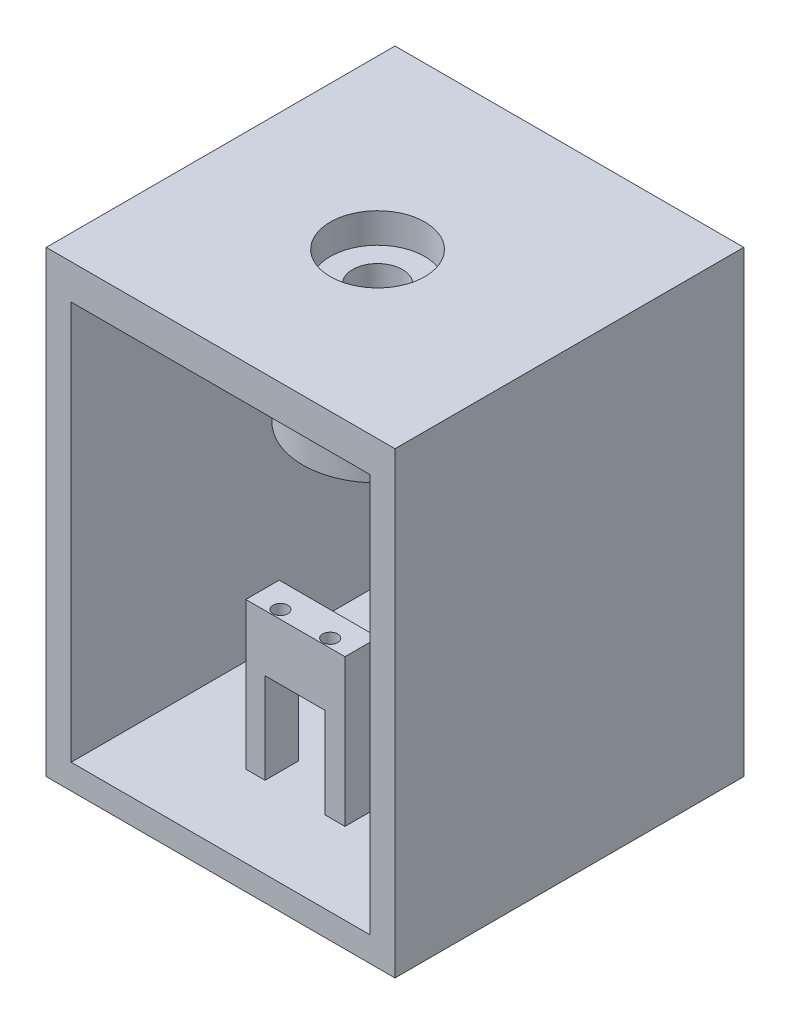
ISO-10303-21;
HEADER;
FILE_DESCRIPTION(('STEP AP214'),'2;1');
FILE_NAME('part.step','',(''),(''),'','','');
FILE_SCHEMA(('AUTOMOTIVE_DESIGN { 1 0 10303 214 1 1 1 1 }'));
ENDSEC;
DATA;
#1=APPLICATION_CONTEXT('core data for automotive mechanical design processes');
#2=APPLICATION_PROTOCOL_DEFINITION('international standard','automotive_design',2000,#1);
#3=PRODUCT_CONTEXT('',#1,'mechanical');
#4=PRODUCT('Part','Part','',(#3));
#5=PRODUCT_RELATED_PRODUCT_CATEGORY('part','',(#4));
#6=PRODUCT_DEFINITION_FORMATION('','',#4);
#7=PRODUCT_DEFINITION_CONTEXT('part definition',#1,'design');
#8=PRODUCT_DEFINITION('design','',#6,#7);
#9=PRODUCT_DEFINITION_SHAPE('','',#8);
#10=(LENGTH_UNIT() NAMED_UNIT(*) SI_UNIT(.MILLI.,.METRE.));
#11=(NAMED_UNIT(*) PLANE_ANGLE_UNIT() SI_UNIT($,.RADIAN.));
#12=(NAMED_UNIT(*) SI_UNIT($,.STERADIAN.) SOLID_ANGLE_UNIT());
#13=UNCERTAINTY_MEASURE_WITH_UNIT(LENGTH_MEASURE(1.E-05),#10,'distance_accuracy_value','');
#14=(GEOMETRIC_REPRESENTATION_CONTEXT(3) GLOBAL_UNCERTAINTY_ASSIGNED_CONTEXT((#13)) GLOBAL_UNIT_ASSIGNED_CONTEXT((#10,
#11,#12)) REPRESENTATION_CONTEXT('',''));
#15=CARTESIAN_POINT('',(0.,0.,0.));
#16=DIRECTION('',(0.,0.,1.));
#17=DIRECTION('',(1.,0.,0.));
#18=AXIS2_PLACEMENT_3D('',#15,#16,#17);
#19=CARTESIAN_POINT('',(-4.64981001313193,-50.5,14.8500000000001));
#20=DIRECTION('',(0.,1.,0.));
#21=DIRECTION('',(0.,0.,1.));
#22=AXIS2_PLACEMENT_3D('',#19,#20,#21);
#23=PLANE('',#22);
#24=CARTESIAN_POINT('',(-4.64981001313193,-50.5,14.8500000000001));
#25=DIRECTION('',(0.,1.,0.));
#26=DIRECTION('',(0.,0.,1.));
#27=AXIS2_PLACEMENT_3D('',#24,#25,#26);
#28=CIRCLE('',#27,1.5);
#29=CARTESIAN_POINT('',(-4.64981001313193,-50.5,16.3500000000001));
#30=VERTEX_POINT('',#29);
#31=EDGE_CURVE('E271',#30,#30,#28,.T.);
#32=ORIENTED_EDGE('',*,*,#31,.T.);
#33=EDGE_LOOP('',(#32));
#34=FACE_BOUND('',#33,.T.);
#35=ADVANCED_FACE('F34',(#34),#23,.T.);
#36=CARTESIAN_POINT('',(5.35018998686807,-50.5,14.8500000000001));
#37=DIRECTION('',(0.,1.,0.));
#38=DIRECTION('',(0.,0.,1.));
#39=AXIS2_PLACEMENT_3D('',#36,#37,#38);
#40=PLANE('',#39);
#41=CARTESIAN_POINT('',(5.35018998686807,-50.5,14.8500000000001));
#42=DIRECTION('',(0.,1.,0.));
#43=DIRECTION('',(0.,0.,1.));
#44=AXIS2_PLACEMENT_3D('',#41,#42,#43);
#45=CIRCLE('',#44,1.5);
#46=CARTESIAN_POINT('',(5.35018998686807,-50.5,16.3500000000001));
#47=VERTEX_POINT('',#46);
#48=EDGE_CURVE('E269',#47,#47,#45,.T.);
#49=ORIENTED_EDGE('',*,*,#48,.T.);
#50=EDGE_LOOP('',(#49));
#51=FACE_BOUND('',#50,.T.);
#52=ADVANCED_FACE('F616',(#51),#40,.T.);
#53=CARTESIAN_POINT('',(0.,-7.,0.));
#54=DIRECTION('',(0.,-1.,0.));
#55=DIRECTION('',(0.,0.,-1.));
#56=AXIS2_PLACEMENT_3D('',#53,#54,#55);
#57=PLANE('',#56);
#58=CARTESIAN_POINT('',(0.,-7.,0.));
#59=DIRECTION('',(0.,-1.,0.));
#60=DIRECTION('',(0.,0.,-1.));
#61=AXIS2_PLACEMENT_3D('',#58,#59,#60);
#62=CIRCLE('',#61,5.);
#63=CARTESIAN_POINT('',(0.,-7.,-5.));
#64=VERTEX_POINT('',#63);
#65=EDGE_CURVE('E276',#64,#64,#62,.T.);
#66=ORIENTED_EDGE('',*,*,#65,.F.);
#67=EDGE_LOOP('',(#66));
#68=FACE_BOUND('',#67,.T.);
#69=CARTESIAN_POINT('',(0.,-7.,0.));
#70=DIRECTION('',(0.,-1.,0.));
#71=DIRECTION('',(0.,0.,-1.));
#72=AXIS2_PLACEMENT_3D('',#69,#70,#71);
#73=CIRCLE('',#72,9.5);
#74=CARTESIAN_POINT('',(0.,-7.,-9.5));
#75=VERTEX_POINT('',#74);
#76=EDGE_CURVE('E37',#75,#75,#73,.T.);
#77=ORIENTED_EDGE('',*,*,#76,.T.);
#78=EDGE_LOOP('',(#77));
#79=FACE_BOUND('',#78,.T.);
#80=ADVANCED_FACE('F613',(#68,#79),#57,.T.);
#81=CARTESIAN_POINT('',(0.,-7.,0.));
#82=DIRECTION('',(0.,-1.,0.));
#83=DIRECTION('',(0.,0.,-1.));
#84=AXIS2_PLACEMENT_3D('',#81,#82,#83);
#85=CYLINDRICAL_SURFACE('',#84,9.5);
#86=ORIENTED_EDGE('',*,*,#76,.F.);
#87=EDGE_LOOP('',(#86));
#88=FACE_BOUND('',#87,.T.);
#89=CARTESIAN_POINT('',(0.,-13.,0.));
#90=DIRECTION('',(0.,-1.,0.));
#91=DIRECTION('',(0.,0.,-1.));
#92=AXIS2_PLACEMENT_3D('',#89,#90,#91);
#93=CIRCLE('',#92,9.5);
#94=CARTESIAN_POINT('',(0.,-13.,-9.5));
#95=VERTEX_POINT('',#94);
#96=EDGE_CURVE('E266',#95,#95,#93,.T.);
#97=ORIENTED_EDGE('',*,*,#96,.T.);
#98=EDGE_LOOP('',(#97));
#99=FACE_BOUND('',#98,.T.);
#100=ADVANCED_FACE('F609',(#88,#99),#85,.F.);
#101=CARTESIAN_POINT('',(-4.64981001313193,-50.5,14.8500000000001));
#102=DIRECTION('',(0.,1.,0.));
#103=DIRECTION('',(0.,0.,1.));
#104=AXIS2_PLACEMENT_3D('',#101,#102,#103);
#105=CYLINDRICAL_SURFACE('',#104,1.5);
#106=CARTESIAN_POINT('',(-4.64981001313193,-40.5,14.8500000000001));
#107=DIRECTION('',(0.,1.,0.));
#108=DIRECTION('',(0.,0.,1.));
#109=AXIS2_PLACEMENT_3D('',#106,#107,#108);
#110=CIRCLE('',#109,1.5);
#111=CARTESIAN_POINT('',(-4.64981001313193,-40.5,16.3500000000001));
#112=VERTEX_POINT('',#111);
#113=EDGE_CURVE('E263',#112,#112,#110,.F.);
#114=ORIENTED_EDGE('',*,*,#113,.F.);
#115=EDGE_LOOP('',(#114));
#116=FACE_BOUND('',#115,.T.);
#117=ORIENTED_EDGE('',*,*,#31,.F.);
#118=EDGE_LOOP('',(#117));
#119=FACE_BOUND('',#118,.T.);
#120=ADVANCED_FACE('F602',(#116,#119),#105,.F.);
#121=CARTESIAN_POINT('',(5.35018998686807,-50.5,14.8500000000001));
#122=DIRECTION('',(0.,1.,0.));
#123=DIRECTION('',(0.,0.,1.));
#124=AXIS2_PLACEMENT_3D('',#121,#122,#123);
#125=CYLINDRICAL_SURFACE('',#124,1.5);
#126=CARTESIAN_POINT('',(5.35018998686807,-40.5,14.8500000000001));
#127=DIRECTION('',(0.,1.,0.));
#128=DIRECTION('',(0.,0.,1.));
#129=AXIS2_PLACEMENT_3D('',#126,#127,#128);
#130=CIRCLE('',#129,1.5);
#131=CARTESIAN_POINT('',(5.35018998686807,-40.5,16.3500000000001));
#132=VERTEX_POINT('',#131);
#133=EDGE_CURVE('E260',#132,#132,#130,.F.);
#134=ORIENTED_EDGE('',*,*,#133,.F.);
#135=EDGE_LOOP('',(#134));
#136=FACE_BOUND('',#135,.T.);
#137=ORIENTED_EDGE('',*,*,#48,.F.);
#138=EDGE_LOOP('',(#137));
#139=FACE_BOUND('',#138,.T.);
#140=ADVANCED_FACE('F594',(#136,#139),#125,.F.);
#141=CARTESIAN_POINT('',(5.35018998686808,-50.5,-35.6499999999999));
#142=DIRECTION('',(0.,1.,0.));
#143=DIRECTION('',(0.,0.,1.));
#144=AXIS2_PLACEMENT_3D('',#141,#142,#143);
#145=PLANE('',#144);
#146=CARTESIAN_POINT('',(5.35018998686808,-50.5,-35.6499999999999));
#147=DIRECTION('',(0.,1.,0.));
#148=DIRECTION('',(0.,0.,1.));
#149=AXIS2_PLACEMENT_3D('',#146,#147,#148);
#150=CIRCLE('',#149,1.425);
#151=CARTESIAN_POINT('',(5.35018998686808,-50.5,-34.2249999999999));
#152=VERTEX_POINT('',#151);
#153=EDGE_CURVE('E257',#152,#152,#150,.T.);
#154=ORIENTED_EDGE('',*,*,#153,.T.);
#155=EDGE_LOOP('',(#154));
#156=FACE_BOUND('',#155,.T.);
#157=ADVANCED_FACE('F591',(#156),#145,.T.);
#158=CARTESIAN_POINT('',(-4.64981001313192,-50.5,-35.6499999999999));
#159=DIRECTION('',(0.,1.,0.));
#160=DIRECTION('',(0.,0.,1.));
#161=AXIS2_PLACEMENT_3D('',#158,#159,#160);
#162=PLANE('',#161);
#163=CARTESIAN_POINT('',(-4.64981001313192,-50.5,-35.6499999999999));
#164=DIRECTION('',(0.,1.,0.));
#165=DIRECTION('',(0.,0.,1.));
#166=AXIS2_PLACEMENT_3D('',#163,#164,#165);
#167=CIRCLE('',#166,1.425);
#168=CARTESIAN_POINT('',(-4.64981001313192,-50.5,-34.2249999999999));
#169=VERTEX_POINT('',#168);
#170=EDGE_CURVE('E254',#169,#169,#167,.T.);
#171=ORIENTED_EDGE('',*,*,#170,.T.);
#172=EDGE_LOOP('',(#171));
#173=FACE_BOUND('',#172,.T.);
#174=ADVANCED_FACE('F593',(#173),#162,.T.);
#175=CARTESIAN_POINT('',(0.,-13.,0.));
#176=DIRECTION('',(0.,1.,0.));
#177=DIRECTION('',(0.,0.,1.));
#178=AXIS2_PLACEMENT_3D('',#175,#176,#177);
#179=PLANE('',#178);
#180=CARTESIAN_POINT('',(0.,-13.,0.));
#181=DIRECTION('',(0.,1.,0.));
#182=DIRECTION('',(0.,0.,1.));
#183=AXIS2_PLACEMENT_3D('',#180,#181,#182);
#184=CIRCLE('',#183,15.);
#185=CARTESIAN_POINT('',(0.,-13.,15.));
#186=VERTEX_POINT('',#185);
#187=EDGE_CURVE('E228',#186,#186,#184,.T.);
#188=ORIENTED_EDGE('',*,*,#187,.F.);
#189=EDGE_LOOP('',(#188));
#190=FACE_BOUND('',#189,.T.);
#191=ORIENTED_EDGE('',*,*,#96,.F.);
#192=EDGE_LOOP('',(#191));
#193=FACE_BOUND('',#192,.T.);
#194=ADVANCED_FACE('F480',(#190,#193),#179,.F.);
#195=CARTESIAN_POINT('',(0.,-40.5,0.));
#196=DIRECTION('',(0.,1.,0.));
#197=DIRECTION('',(0.,0.,1.));
#198=AXIS2_PLACEMENT_3D('',#195,#196,#197);
#199=PLANE('',#198);
#200=DIRECTION('',(0.,0.,1.));
#201=VECTOR('',#200,1.);
#202=CARTESIAN_POINT('',(10.037036461965,-40.5,9.87558863527532));
#203=LINE('',#202,#201);
#204=CARTESIAN_POINT('',(10.037036461965,-40.5,16.5755886352753));
#205=VERTEX_POINT('',#204);
#206=CARTESIAN_POINT('',(10.037036461965,-40.5,9.87558863527532));
#207=VERTEX_POINT('',#206);
#208=EDGE_CURVE('E222',#205,#207,#203,.F.);
#209=ORIENTED_EDGE('',*,*,#208,.T.);
#210=DIRECTION('',(1.,0.,0.));
#211=VECTOR('',#210,1.);
#212=CARTESIAN_POINT('',(-9.86296353803503,-40.5,9.87558863527533));
#213=LINE('',#212,#211);
#214=CARTESIAN_POINT('',(-9.86296353803503,-40.5,9.87558863527533));
#215=VERTEX_POINT('',#214);
#216=EDGE_CURVE('E213',#207,#215,#213,.F.);
#217=ORIENTED_EDGE('',*,*,#216,.T.);
#218=DIRECTION('',(0.,0.,-1.));
#219=VECTOR('',#218,1.);
#220=CARTESIAN_POINT('',(-9.86296353803503,-40.5,9.87558863527533));
#221=LINE('',#220,#219);
#222=CARTESIAN_POINT('',(-9.86296353803503,-40.5,16.5755886352753));
#223=VERTEX_POINT('',#222);
#224=EDGE_CURVE('E196',#215,#223,#221,.F.);
#225=ORIENTED_EDGE('',*,*,#224,.T.);
#226=DIRECTION('',(-1.,0.,0.));
#227=VECTOR('',#226,1.);
#228=CARTESIAN_POINT('',(-9.86296353803503,-40.5,16.5755886352753));
#229=LINE('',#228,#227);
#230=EDGE_CURVE('E434',#223,#205,#229,.F.);
#231=ORIENTED_EDGE('',*,*,#230,.T.);
#232=EDGE_LOOP('',(#209,#217,#225,#231));
#233=FACE_BOUND('',#232,.T.);
#234=ORIENTED_EDGE('',*,*,#133,.T.);
#235=EDGE_LOOP('',(#234));
#236=FACE_BOUND('',#235,.T.);
#237=ORIENTED_EDGE('',*,*,#113,.T.);
#238=EDGE_LOOP('',(#237));
#239=FACE_BOUND('',#238,.T.);
#240=ADVANCED_FACE('F220',(#233,#236,#239),#199,.T.);
#241=CARTESIAN_POINT('',(-6.,-51.82567157,32.9055886352753));
#242=DIRECTION('',(0.,1.,0.));
#243=DIRECTION('',(0.,0.,1.));
#244=AXIS2_PLACEMENT_3D('',#241,#242,#243);
#245=PLANE('',#244);
#246=DIRECTION('',(1.,0.,0.));
#247=VECTOR('',#246,1.);
#248=CARTESIAN_POINT('',(-9.86296353803503,-51.82567157,9.87558863527533));
#249=LINE('',#248,#247);
#250=CARTESIAN_POINT('',(-6.,-51.82567157,9.87558863527533));
#251=VERTEX_POINT('',#250);
#252=CARTESIAN_POINT('',(6.,-51.82567157,9.87558863527533));
#253=VERTEX_POINT('',#252);
#254=EDGE_CURVE('E446',#251,#253,#249,.T.);
#255=ORIENTED_EDGE('',*,*,#254,.T.);
#256=DIRECTION('',(0.,0.,1.));
#257=VECTOR('',#256,1.);
#258=CARTESIAN_POINT('',(6.,-51.82567157,-37.0944113647247));
#259=LINE('',#258,#257);
#260=CARTESIAN_POINT('',(6.,-51.82567157,16.5755886352753));
#261=VERTEX_POINT('',#260);
#262=EDGE_CURVE('E207',#253,#261,#259,.T.);
#263=ORIENTED_EDGE('',*,*,#262,.T.);
#264=DIRECTION('',(-1.,0.,0.));
#265=VECTOR('',#264,1.);
#266=CARTESIAN_POINT('',(-9.86296353803503,-51.82567157,16.5755886352753));
#267=LINE('',#266,#265);
#268=CARTESIAN_POINT('',(-6.,-51.82567157,16.5755886352753));
#269=VERTEX_POINT('',#268);
#270=EDGE_CURVE('E251',#261,#269,#267,.T.);
#271=ORIENTED_EDGE('',*,*,#270,.T.);
#272=DIRECTION('',(0.,0.,1.));
#273=VECTOR('',#272,1.);
#274=CARTESIAN_POINT('',(-6.,-51.82567157,-37.0944113647247));
#275=LINE('',#274,#273);
#276=EDGE_CURVE('E191',#269,#251,#275,.F.);
#277=ORIENTED_EDGE('',*,*,#276,.T.);
#278=EDGE_LOOP('',(#255,#263,#271,#277));
#279=FACE_BOUND('',#278,.T.);
#280=ADVANCED_FACE('F469',(#279),#245,.F.);
#281=CARTESIAN_POINT('',(0.,11.,0.));
#282=DIRECTION('',(0.,1.,0.));
#283=DIRECTION('',(0.,0.,1.));
#284=AXIS2_PLACEMENT_3D('',#281,#282,#283);
#285=PLANE('',#284);
#286=CARTESIAN_POINT('',(0.,11.,0.));
#287=DIRECTION('',(0.,1.,0.));
#288=DIRECTION('',(0.,0.,1.));
#289=AXIS2_PLACEMENT_3D('',#286,#287,#288);
#290=CIRCLE('',#289,5.);
#291=CARTESIAN_POINT('',(0.,11.,5.));
#292=VERTEX_POINT('',#291);
#293=EDGE_CURVE('E280',#292,#292,#290,.T.);
#294=ORIENTED_EDGE('',*,*,#293,.F.);
#295=EDGE_LOOP('',(#294));
#296=FACE_BOUND('',#295,.T.);
#297=CARTESIAN_POINT('',(0.,11.,0.));
#298=DIRECTION('',(0.,1.,0.));
#299=DIRECTION('',(0.,0.,1.));
#300=AXIS2_PLACEMENT_3D('',#297,#298,#299);
#301=CIRCLE('',#300,9.5);
#302=CARTESIAN_POINT('',(0.,11.,9.5));
#303=VERTEX_POINT('',#302);
#304=EDGE_CURVE('E247',#303,#303,#301,.T.);
#305=ORIENTED_EDGE('',*,*,#304,.T.);
#306=EDGE_LOOP('',(#305));
#307=FACE_BOUND('',#306,.T.);
#308=ADVANCED_FACE('F471',(#296,#307),#285,.T.);
#309=CARTESIAN_POINT('',(5.35018998686808,-50.5,-35.6499999999999));
#310=DIRECTION('',(0.,1.,0.));
#311=DIRECTION('',(0.,0.,1.));
#312=AXIS2_PLACEMENT_3D('',#309,#310,#311);
#313=CYLINDRICAL_SURFACE('',#312,1.425);
#314=CARTESIAN_POINT('',(5.35018998686808,-40.5,-35.6499999999999));
#315=DIRECTION('',(0.,1.,0.));
#316=DIRECTION('',(0.,0.,1.));
#317=AXIS2_PLACEMENT_3D('',#314,#315,#316);
#318=CIRCLE('',#317,1.425);
#319=CARTESIAN_POINT('',(5.35018998686808,-40.5,-34.2249999999999));
#320=VERTEX_POINT('',#319);
#321=EDGE_CURVE('E243',#320,#320,#318,.F.);
#322=ORIENTED_EDGE('',*,*,#321,.F.);
#323=EDGE_LOOP('',(#322));
#324=FACE_BOUND('',#323,.T.);
#325=ORIENTED_EDGE('',*,*,#153,.F.);
#326=EDGE_LOOP('',(#325));
#327=FACE_BOUND('',#326,.T.);
#328=ADVANCED_FACE('F477',(#324,#327),#313,.F.);
#329=CARTESIAN_POINT('',(-4.64981001313192,-50.5,-35.6499999999999));
#330=DIRECTION('',(0.,1.,0.));
#331=DIRECTION('',(0.,0.,1.));
#332=AXIS2_PLACEMENT_3D('',#329,#330,#331);
#333=CYLINDRICAL_SURFACE('',#332,1.425);
#334=CARTESIAN_POINT('',(-4.64981001313192,-40.5,-35.6499999999999));
#335=DIRECTION('',(0.,1.,0.));
#336=DIRECTION('',(0.,0.,1.));
#337=AXIS2_PLACEMENT_3D('',#334,#335,#336);
#338=CIRCLE('',#337,1.425);
#339=CARTESIAN_POINT('',(-4.64981001313192,-40.5,-34.2249999999999));
#340=VERTEX_POINT('',#339);
#341=EDGE_CURVE('E239',#340,#340,#338,.F.);
#342=ORIENTED_EDGE('',*,*,#341,.F.);
#343=EDGE_LOOP('',(#342));
#344=FACE_BOUND('',#343,.T.);
#345=ORIENTED_EDGE('',*,*,#170,.F.);
#346=EDGE_LOOP('',(#345));
#347=FACE_BOUND('',#346,.T.);
#348=ADVANCED_FACE('F578',(#344,#347),#333,.F.);
#349=CARTESIAN_POINT('',(0.,-13.,0.));
#350=DIRECTION('',(0.,1.,0.));
#351=DIRECTION('',(0.,0.,1.));
#352=AXIS2_PLACEMENT_3D('',#349,#350,#351);
#353=CYLINDRICAL_SURFACE('',#352,15.);
#354=ORIENTED_EDGE('',*,*,#187,.T.);
#355=EDGE_LOOP('',(#354));
#356=FACE_BOUND('',#355,.T.);
#357=CARTESIAN_POINT('',(0.,10.,0.));
#358=DIRECTION('',(0.,1.,0.));
#359=DIRECTION('',(0.,0.,1.));
#360=AXIS2_PLACEMENT_3D('',#357,#358,#359);
#361=CIRCLE('',#360,15.);
#362=CARTESIAN_POINT('',(0.,10.,15.));
#363=VERTEX_POINT('',#362);
#364=EDGE_CURVE('E234',#363,#363,#361,.F.);
#365=ORIENTED_EDGE('',*,*,#364,.T.);
#366=EDGE_LOOP('',(#365));
#367=FACE_BOUND('',#366,.T.);
#368=ADVANCED_FACE('F575',(#356,#367),#353,.T.);
#369=CARTESIAN_POINT('',(-6.,-54.,-37.0944113647247));
#370=DIRECTION('',(-1.,0.,0.));
#371=DIRECTION('',(0.,-1.,0.));
#372=AXIS2_PLACEMENT_3D('',#369,#370,#371);
#373=PLANE('',#372);
#374=DIRECTION('',(0.,1.,0.));
#375=VECTOR('',#374,1.);
#376=CARTESIAN_POINT('',(-6.,-40.5,9.87558863527533));
#377=LINE('',#376,#375);
#378=CARTESIAN_POINT('',(-6.,-70.,9.87558863527533));
#379=VERTEX_POINT('',#378);
#380=EDGE_CURVE('E217',#379,#251,#377,.T.);
#381=ORIENTED_EDGE('',*,*,#380,.T.);
#382=ORIENTED_EDGE('',*,*,#276,.F.);
#383=DIRECTION('',(0.,1.,0.));
#384=VECTOR('',#383,1.);
#385=CARTESIAN_POINT('',(-6.,-40.5,16.5755886352753));
#386=LINE('',#385,#384);
#387=CARTESIAN_POINT('',(-6.,-70.,16.5755886352753));
#388=VERTEX_POINT('',#387);
#389=EDGE_CURVE('E437',#269,#388,#386,.F.);
#390=ORIENTED_EDGE('',*,*,#389,.T.);
#391=DIRECTION('',(0.,0.,1.));
#392=VECTOR('',#391,1.);
#393=CARTESIAN_POINT('',(-6.,-70.,0.));
#394=LINE('',#393,#392);
#395=EDGE_CURVE('E390',#379,#388,#394,.T.);
#396=ORIENTED_EDGE('',*,*,#395,.F.);
#397=EDGE_LOOP('',(#381,#382,#390,#396));
#398=FACE_BOUND('',#397,.T.);
#399=ADVANCED_FACE('F450',(#398),#373,.F.);
#400=CARTESIAN_POINT('',(-9.86296353803503,-40.5,9.87558863527533));
#401=DIRECTION('',(1.,0.,0.));
#402=DIRECTION('',(0.,0.,-1.));
#403=AXIS2_PLACEMENT_3D('',#400,#401,#402);
#404=PLANE('',#403);
#405=DIRECTION('',(0.,1.,0.));
#406=VECTOR('',#405,1.);
#407=CARTESIAN_POINT('',(-9.86296353803503,-40.5,16.5755886352753));
#408=LINE('',#407,#406);
#409=CARTESIAN_POINT('',(-9.86296353803503,-70.,16.5755886352753));
#410=VERTEX_POINT('',#409);
#411=EDGE_CURVE('E202',#410,#223,#408,.T.);
#412=ORIENTED_EDGE('',*,*,#411,.T.);
#413=ORIENTED_EDGE('',*,*,#224,.F.);
#414=DIRECTION('',(0.,1.,0.));
#415=VECTOR('',#414,1.);
#416=CARTESIAN_POINT('',(-9.86296353803503,-40.5,9.87558863527533));
#417=LINE('',#416,#415);
#418=CARTESIAN_POINT('',(-9.86296353803503,-70.,9.87558863527533));
#419=VERTEX_POINT('',#418);
#420=EDGE_CURVE('E200',#215,#419,#417,.F.);
#421=ORIENTED_EDGE('',*,*,#420,.T.);
#422=DIRECTION('',(0.,0.,1.));
#423=VECTOR('',#422,1.);
#424=CARTESIAN_POINT('',(-9.86296353803503,-70.,0.));
#425=LINE('',#424,#423);
#426=EDGE_CURVE('E385',#410,#419,#425,.F.);
#427=ORIENTED_EDGE('',*,*,#426,.F.);
#428=EDGE_LOOP('',(#412,#413,#421,#427));
#429=FACE_BOUND('',#428,.T.);
#430=ADVANCED_FACE('F198',(#429),#404,.F.);
#431=CARTESIAN_POINT('',(6.,-54.,-37.0944113647247));
#432=DIRECTION('',(1.,0.,0.));
#433=DIRECTION('',(0.,1.,0.));
#434=AXIS2_PLACEMENT_3D('',#431,#432,#433);
#435=PLANE('',#434);
#436=ORIENTED_EDGE('',*,*,#262,.F.);
#437=DIRECTION('',(0.,1.,0.));
#438=VECTOR('',#437,1.);
#439=CARTESIAN_POINT('',(6.,-40.5,9.87558863527532));
#440=LINE('',#439,#438);
#441=CARTESIAN_POINT('',(6.,-70.,9.87558863527533));
#442=VERTEX_POINT('',#441);
#443=EDGE_CURVE('E443',#253,#442,#440,.F.);
#444=ORIENTED_EDGE('',*,*,#443,.T.);
#445=DIRECTION('',(0.,0.,1.));
#446=VECTOR('',#445,1.);
#447=CARTESIAN_POINT('',(6.,-70.,0.));
#448=LINE('',#447,#446);
#449=CARTESIAN_POINT('',(6.,-70.,16.5755886352753));
#450=VERTEX_POINT('',#449);
#451=EDGE_CURVE('E383',#450,#442,#448,.F.);
#452=ORIENTED_EDGE('',*,*,#451,.F.);
#453=DIRECTION('',(0.,1.,0.));
#454=VECTOR('',#453,1.);
#455=CARTESIAN_POINT('',(6.,-40.5,16.5755886352753));
#456=LINE('',#455,#454);
#457=EDGE_CURVE('E428',#450,#261,#456,.T.);
#458=ORIENTED_EDGE('',*,*,#457,.T.);
#459=EDGE_LOOP('',(#436,#444,#452,#458));
#460=FACE_BOUND('',#459,.T.);
#461=ADVANCED_FACE('F468',(#460),#435,.F.);
#462=CARTESIAN_POINT('',(-9.86296353803503,-40.5,9.87558863527533));
#463=DIRECTION('',(0.,0.,1.));
#464=DIRECTION('',(1.,0.,0.));
#465=AXIS2_PLACEMENT_3D('',#462,#463,#464);
#466=PLANE('',#465);
#467=ORIENTED_EDGE('',*,*,#254,.F.);
#468=ORIENTED_EDGE('',*,*,#380,.F.);
#469=DIRECTION('',(1.,0.,0.));
#470=VECTOR('',#469,1.);
#471=CARTESIAN_POINT('',(0.,-70.,9.87558863527533));
#472=LINE('',#471,#470);
#473=EDGE_CURVE('E216',#419,#379,#472,.T.);
#474=ORIENTED_EDGE('',*,*,#473,.F.);
#475=ORIENTED_EDGE('',*,*,#420,.F.);
#476=ORIENTED_EDGE('',*,*,#216,.F.);
#477=DIRECTION('',(0.,1.,0.));
#478=VECTOR('',#477,1.);
#479=CARTESIAN_POINT('',(10.037036461965,-40.5,9.87558863527532));
#480=LINE('',#479,#478);
#481=CARTESIAN_POINT('',(10.037036461965,-70.,9.87558863527532));
#482=VERTEX_POINT('',#481);
#483=EDGE_CURVE('E440',#207,#482,#480,.F.);
#484=ORIENTED_EDGE('',*,*,#483,.T.);
#485=DIRECTION('',(1.,0.,0.));
#486=VECTOR('',#485,1.);
#487=CARTESIAN_POINT('',(0.,-70.,9.87558863527533));
#488=LINE('',#487,#486);
#489=EDGE_CURVE('E381',#442,#482,#488,.T.);
#490=ORIENTED_EDGE('',*,*,#489,.F.);
#491=ORIENTED_EDGE('',*,*,#443,.F.);
#492=EDGE_LOOP('',(#467,#468,#474,#475,#476,#484,#490,#491));
#493=FACE_BOUND('',#492,.T.);
#494=ADVANCED_FACE('F211',(#493),#466,.F.);
#495=CARTESIAN_POINT('',(10.037036461965,-40.5,9.87558863527532));
#496=DIRECTION('',(-1.,0.,0.));
#497=DIRECTION('',(0.,0.,1.));
#498=AXIS2_PLACEMENT_3D('',#495,#496,#497);
#499=PLANE('',#498);
#500=ORIENTED_EDGE('',*,*,#483,.F.);
#501=ORIENTED_EDGE('',*,*,#208,.F.);
#502=DIRECTION('',(0.,1.,0.));
#503=VECTOR('',#502,1.);
#504=CARTESIAN_POINT('',(10.037036461965,-40.5,16.5755886352753));
#505=LINE('',#504,#503);
#506=CARTESIAN_POINT('',(10.037036461965,-70.,16.5755886352753));
#507=VERTEX_POINT('',#506);
#508=EDGE_CURVE('E431',#205,#507,#505,.F.);
#509=ORIENTED_EDGE('',*,*,#508,.T.);
#510=DIRECTION('',(0.,0.,1.));
#511=VECTOR('',#510,1.);
#512=CARTESIAN_POINT('',(10.037036461965,-70.,0.));
#513=LINE('',#512,#511);
#514=EDGE_CURVE('E379',#482,#507,#513,.T.);
#515=ORIENTED_EDGE('',*,*,#514,.F.);
#516=EDGE_LOOP('',(#500,#501,#509,#515));
#517=FACE_BOUND('',#516,.T.);
#518=ADVANCED_FACE('F463',(#517),#499,.F.);
#519=CARTESIAN_POINT('',(-9.86296353803503,-40.5,16.5755886352753));
#520=DIRECTION('',(0.,0.,-1.));
#521=DIRECTION('',(-1.,0.,0.));
#522=AXIS2_PLACEMENT_3D('',#519,#520,#521);
#523=PLANE('',#522);
#524=ORIENTED_EDGE('',*,*,#457,.F.);
#525=DIRECTION('',(1.,0.,0.));
#526=VECTOR('',#525,1.);
#527=CARTESIAN_POINT('',(0.,-70.,16.5755886352753));
#528=LINE('',#527,#526);
#529=EDGE_CURVE('E376',#507,#450,#528,.F.);
#530=ORIENTED_EDGE('',*,*,#529,.F.);
#531=ORIENTED_EDGE('',*,*,#508,.F.);
#532=ORIENTED_EDGE('',*,*,#230,.F.);
#533=ORIENTED_EDGE('',*,*,#411,.F.);
#534=DIRECTION('',(1.,0.,0.));
#535=VECTOR('',#534,1.);
#536=CARTESIAN_POINT('',(0.,-70.,16.5755886352753));
#537=LINE('',#536,#535);
#538=EDGE_CURVE('E387',#388,#410,#537,.F.);
#539=ORIENTED_EDGE('',*,*,#538,.F.);
#540=ORIENTED_EDGE('',*,*,#389,.F.);
#541=ORIENTED_EDGE('',*,*,#270,.F.);
#542=EDGE_LOOP('',(#524,#530,#531,#532,#533,#539,#540,#541));
#543=FACE_BOUND('',#542,.T.);
#544=ADVANCED_FACE('F457',(#543),#523,.F.);
#545=CARTESIAN_POINT('',(9.87703646196496,-40.5,-30.5044113647247));
#546=DIRECTION('',(0.,0.,-1.));
#547=DIRECTION('',(-1.,0.,0.));
#548=AXIS2_PLACEMENT_3D('',#545,#546,#547);
#549=PLANE('',#548);
#550=DIRECTION('',(0.,1.,0.));
#551=VECTOR('',#550,1.);
#552=CARTESIAN_POINT('',(9.87703646196496,-40.5,-30.5044113647247));
#553=LINE('',#552,#551);
#554=CARTESIAN_POINT('',(9.87703646196496,-70.,-30.5044113647247));
#555=VERTEX_POINT('',#554);
#556=CARTESIAN_POINT('',(9.87703646196496,-40.5,-30.5044113647247));
#557=VERTEX_POINT('',#556);
#558=EDGE_CURVE('E246',#555,#557,#553,.T.);
#559=ORIENTED_EDGE('',*,*,#558,.T.);
#560=DIRECTION('',(1.,0.,0.));
#561=VECTOR('',#560,1.);
#562=CARTESIAN_POINT('',(0.,-40.5,-30.5044113647247));
#563=LINE('',#562,#561);
#564=CARTESIAN_POINT('',(-10.022963538035,-40.5,-30.5044113647247));
#565=VERTEX_POINT('',#564);
#566=EDGE_CURVE('E399',#565,#557,#563,.T.);
#567=ORIENTED_EDGE('',*,*,#566,.F.);
#568=DIRECTION('',(0.,1.,0.));
#569=VECTOR('',#568,1.);
#570=CARTESIAN_POINT('',(-10.022963538035,-40.5,-30.5044113647247));
#571=LINE('',#570,#569);
#572=CARTESIAN_POINT('',(-10.022963538035,-70.,-30.5044113647247));
#573=VERTEX_POINT('',#572);
#574=EDGE_CURVE('E238',#565,#573,#571,.F.);
#575=ORIENTED_EDGE('',*,*,#574,.T.);
#576=DIRECTION('',(1.,0.,0.));
#577=VECTOR('',#576,1.);
#578=CARTESIAN_POINT('',(0.,-70.,-30.5044113647247));
#579=LINE('',#578,#577);
#580=EDGE_CURVE('E371',#555,#573,#579,.F.);
#581=ORIENTED_EDGE('',*,*,#580,.F.);
#582=EDGE_LOOP('',(#559,#567,#575,#581));
#583=FACE_BOUND('',#582,.T.);
#584=DIRECTION('',(0.,1.,0.));
#585=VECTOR('',#584,1.);
#586=CARTESIAN_POINT('',(6.,-69.82567157,-30.5044113647247));
#587=LINE('',#586,#585);
#588=CARTESIAN_POINT('',(6.,-51.82567157,-30.5044113647247));
#589=VERTEX_POINT('',#588);
#590=CARTESIAN_POINT('',(6.,-69.82567157,-30.5044113647247));
#591=VERTEX_POINT('',#590);
#592=EDGE_CURVE('E416',#589,#591,#587,.F.);
#593=ORIENTED_EDGE('',*,*,#592,.T.);
#594=DIRECTION('',(1.,0.,0.));
#595=VECTOR('',#594,1.);
#596=CARTESIAN_POINT('',(-6.,-69.82567157,-30.5044113647247));
#597=LINE('',#596,#595);
#598=CARTESIAN_POINT('',(-6.,-69.82567157,-30.5044113647247));
#599=VERTEX_POINT('',#598);
#600=EDGE_CURVE('E410',#591,#599,#597,.F.);
#601=ORIENTED_EDGE('',*,*,#600,.T.);
#602=DIRECTION('',(0.,1.,0.));
#603=VECTOR('',#602,1.);
#604=CARTESIAN_POINT('',(-6.,-69.82567157,-30.5044113647247));
#605=LINE('',#604,#603);
#606=CARTESIAN_POINT('',(-6.,-51.82567157,-30.5044113647247));
#607=VERTEX_POINT('',#606);
#608=EDGE_CURVE('E250',#599,#607,#605,.T.);
#609=ORIENTED_EDGE('',*,*,#608,.T.);
#610=DIRECTION('',(1.,0.,0.));
#611=VECTOR('',#610,1.);
#612=CARTESIAN_POINT('',(-6.,-51.82567157,-30.5044113647247));
#613=LINE('',#612,#611);
#614=EDGE_CURVE('E422',#607,#589,#613,.T.);
#615=ORIENTED_EDGE('',*,*,#614,.T.);
#616=EDGE_LOOP('',(#593,#601,#609,#615));
#617=FACE_BOUND('',#616,.T.);
#618=ADVANCED_FACE('F558',(#583,#617),#549,.F.);
#619=CARTESIAN_POINT('',(0.,11.,0.));
#620=DIRECTION('',(0.,1.,0.));
#621=DIRECTION('',(0.,0.,1.));
#622=AXIS2_PLACEMENT_3D('',#619,#620,#621);
#623=CYLINDRICAL_SURFACE('',#622,9.5);
#624=CARTESIAN_POINT('',(0.,17.,0.));
#625=DIRECTION('',(0.,1.,0.));
#626=DIRECTION('',(0.,0.,1.));
#627=AXIS2_PLACEMENT_3D('',#624,#625,#626);
#628=CIRCLE('',#627,9.5);
#629=CARTESIAN_POINT('',(0.,17.,9.5));
#630=VERTEX_POINT('',#629);
#631=EDGE_CURVE('E229',#630,#630,#628,.F.);
#632=ORIENTED_EDGE('',*,*,#631,.F.);
#633=EDGE_LOOP('',(#632));
#634=FACE_BOUND('',#633,.T.);
#635=ORIENTED_EDGE('',*,*,#304,.F.);
#636=EDGE_LOOP('',(#635));
#637=FACE_BOUND('',#636,.T.);
#638=ADVANCED_FACE('F554',(#634,#637),#623,.F.);
#639=CARTESIAN_POINT('',(-6.,-69.82567157,32.9055886352753));
#640=DIRECTION('',(-1.,0.,0.));
#641=DIRECTION('',(0.,0.,1.));
#642=AXIS2_PLACEMENT_3D('',#639,#640,#641);
#643=PLANE('',#642);
#644=DIRECTION('',(0.,1.,0.));
#645=VECTOR('',#644,1.);
#646=CARTESIAN_POINT('',(-6.,7.,-37.0944113647247));
#647=LINE('',#646,#645);
#648=CARTESIAN_POINT('',(-6.,-69.82567157,-37.0944113647247));
#649=VERTEX_POINT('',#648);
#650=CARTESIAN_POINT('',(-6.,-51.82567157,-37.0944113647247));
#651=VERTEX_POINT('',#650);
#652=EDGE_CURVE('E358',#649,#651,#647,.T.);
#653=ORIENTED_EDGE('',*,*,#652,.T.);
#654=DIRECTION('',(0.,0.,1.));
#655=VECTOR('',#654,1.);
#656=CARTESIAN_POINT('',(-6.,-51.82567157,32.9055886352753));
#657=LINE('',#656,#655);
#658=EDGE_CURVE('E419',#651,#607,#657,.T.);
#659=ORIENTED_EDGE('',*,*,#658,.T.);
#660=ORIENTED_EDGE('',*,*,#608,.F.);
#661=DIRECTION('',(0.,0.,-1.));
#662=VECTOR('',#661,1.);
#663=CARTESIAN_POINT('',(-6.,-69.82567157,32.9055886352753));
#664=LINE('',#663,#662);
#665=EDGE_CURVE('E407',#599,#649,#664,.T.);
#666=ORIENTED_EDGE('',*,*,#665,.T.);
#667=EDGE_LOOP('',(#653,#659,#660,#666));
#668=FACE_BOUND('',#667,.T.);
#669=ADVANCED_FACE('F550',(#668),#643,.F.);
#670=CARTESIAN_POINT('',(-6.,-51.82567157,32.9055886352753));
#671=DIRECTION('',(0.,1.,0.));
#672=DIRECTION('',(0.,0.,1.));
#673=AXIS2_PLACEMENT_3D('',#670,#671,#672);
#674=PLANE('',#673);
#675=DIRECTION('',(1.,0.,0.));
#676=VECTOR('',#675,1.);
#677=CARTESIAN_POINT('',(-33.592963538035,-51.82567157,-37.0944113647247));
#678=LINE('',#677,#676);
#679=CARTESIAN_POINT('',(6.,-51.82567157,-37.0944113647247));
#680=VERTEX_POINT('',#679);
#681=EDGE_CURVE('E355',#651,#680,#678,.T.);
#682=ORIENTED_EDGE('',*,*,#681,.T.);
#683=DIRECTION('',(0.,0.,-1.));
#684=VECTOR('',#683,1.);
#685=CARTESIAN_POINT('',(6.,-51.82567157,32.9055886352753));
#686=LINE('',#685,#684);
#687=EDGE_CURVE('E413',#680,#589,#686,.F.);
#688=ORIENTED_EDGE('',*,*,#687,.T.);
#689=ORIENTED_EDGE('',*,*,#614,.F.);
#690=ORIENTED_EDGE('',*,*,#658,.F.);
#691=EDGE_LOOP('',(#682,#688,#689,#690));
#692=FACE_BOUND('',#691,.T.);
#693=ADVANCED_FACE('F546',(#692),#674,.F.);
#694=CARTESIAN_POINT('',(6.,-69.82567157,32.9055886352753));
#695=DIRECTION('',(1.,0.,0.));
#696=DIRECTION('',(0.,0.,-1.));
#697=AXIS2_PLACEMENT_3D('',#694,#695,#696);
#698=PLANE('',#697);
#699=DIRECTION('',(0.,1.,0.));
#700=VECTOR('',#699,1.);
#701=CARTESIAN_POINT('',(6.,7.,-37.0944113647247));
#702=LINE('',#701,#700);
#703=CARTESIAN_POINT('',(6.,-69.82567157,-37.0944113647247));
#704=VERTEX_POINT('',#703);
#705=EDGE_CURVE('E352',#680,#704,#702,.F.);
#706=ORIENTED_EDGE('',*,*,#705,.T.);
#707=DIRECTION('',(0.,0.,-1.));
#708=VECTOR('',#707,1.);
#709=CARTESIAN_POINT('',(6.,-69.82567157,32.9055886352753));
#710=LINE('',#709,#708);
#711=EDGE_CURVE('E404',#704,#591,#710,.F.);
#712=ORIENTED_EDGE('',*,*,#711,.T.);
#713=ORIENTED_EDGE('',*,*,#592,.F.);
#714=ORIENTED_EDGE('',*,*,#687,.F.);
#715=EDGE_LOOP('',(#706,#712,#713,#714));
#716=FACE_BOUND('',#715,.T.);
#717=ADVANCED_FACE('F542',(#716),#698,.F.);
#718=CARTESIAN_POINT('',(-6.,-69.82567157,32.9055886352753));
#719=DIRECTION('',(0.,-1.,0.));
#720=DIRECTION('',(0.,0.,-1.));
#721=AXIS2_PLACEMENT_3D('',#718,#719,#720);
#722=PLANE('',#721);
#723=DIRECTION('',(1.,0.,0.));
#724=VECTOR('',#723,1.);
#725=CARTESIAN_POINT('',(-33.592963538035,-69.82567157,-37.0944113647247));
#726=LINE('',#725,#724);
#727=EDGE_CURVE('E349',#704,#649,#726,.F.);
#728=ORIENTED_EDGE('',*,*,#727,.T.);
#729=ORIENTED_EDGE('',*,*,#665,.F.);
#730=ORIENTED_EDGE('',*,*,#600,.F.);
#731=ORIENTED_EDGE('',*,*,#711,.F.);
#732=EDGE_LOOP('',(#728,#729,#730,#731));
#733=FACE_BOUND('',#732,.T.);
#734=ADVANCED_FACE('F538',(#733),#722,.F.);
#735=CARTESIAN_POINT('',(9.87703646196496,-40.5,-30.5044113647247));
#736=DIRECTION('',(-1.,0.,0.));
#737=DIRECTION('',(0.,0.,1.));
#738=AXIS2_PLACEMENT_3D('',#735,#736,#737);
#739=PLANE('',#738);
#740=DIRECTION('',(0.,1.,0.));
#741=VECTOR('',#740,1.);
#742=CARTESIAN_POINT('',(9.87703646196496,7.,-37.0944113647247));
#743=LINE('',#742,#741);
#744=CARTESIAN_POINT('',(9.87703646196496,-70.,-37.0944113647247));
#745=VERTEX_POINT('',#744);
#746=CARTESIAN_POINT('',(9.87703646196496,-40.5,-37.0944113647247));
#747=VERTEX_POINT('',#746);
#748=EDGE_CURVE('E338',#745,#747,#743,.T.);
#749=ORIENTED_EDGE('',*,*,#748,.T.);
#750=DIRECTION('',(0.,0.,1.));
#751=VECTOR('',#750,1.);
#752=CARTESIAN_POINT('',(9.87703646196496,-40.5,0.));
#753=LINE('',#752,#751);
#754=EDGE_CURVE('E242',#557,#747,#753,.F.);
#755=ORIENTED_EDGE('',*,*,#754,.F.);
#756=ORIENTED_EDGE('',*,*,#558,.F.);
#757=DIRECTION('',(0.,0.,1.));
#758=VECTOR('',#757,1.);
#759=CARTESIAN_POINT('',(9.87703646196496,-70.,0.));
#760=LINE('',#759,#758);
#761=EDGE_CURVE('E373',#745,#555,#760,.T.);
#762=ORIENTED_EDGE('',*,*,#761,.F.);
#763=EDGE_LOOP('',(#749,#755,#756,#762));
#764=FACE_BOUND('',#763,.T.);
#765=ADVANCED_FACE('F534',(#764),#739,.F.);
#766=CARTESIAN_POINT('',(0.,-40.5,0.));
#767=DIRECTION('',(0.,1.,0.));
#768=DIRECTION('',(0.,0.,1.));
#769=AXIS2_PLACEMENT_3D('',#766,#767,#768);
#770=PLANE('',#769);
#771=DIRECTION('',(0.,0.,-1.));
#772=VECTOR('',#771,1.);
#773=CARTESIAN_POINT('',(-10.022963538035,-40.5,-30.5044113647247));
#774=LINE('',#773,#772);
#775=CARTESIAN_POINT('',(-10.022963538035,-40.5,-37.0944113647247));
#776=VERTEX_POINT('',#775);
#777=EDGE_CURVE('E396',#776,#565,#774,.F.);
#778=ORIENTED_EDGE('',*,*,#777,.T.);
#779=ORIENTED_EDGE('',*,*,#566,.T.);
#780=ORIENTED_EDGE('',*,*,#754,.T.);
#781=DIRECTION('',(1.,0.,0.));
#782=VECTOR('',#781,1.);
#783=CARTESIAN_POINT('',(-33.592963538035,-40.5,-37.0944113647247));
#784=LINE('',#783,#782);
#785=EDGE_CURVE('E335',#747,#776,#784,.F.);
#786=ORIENTED_EDGE('',*,*,#785,.T.);
#787=EDGE_LOOP('',(#778,#779,#780,#786));
#788=FACE_BOUND('',#787,.T.);
#789=ORIENTED_EDGE('',*,*,#341,.T.);
#790=EDGE_LOOP('',(#789));
#791=FACE_BOUND('',#790,.T.);
#792=ORIENTED_EDGE('',*,*,#321,.T.);
#793=EDGE_LOOP('',(#792));
#794=FACE_BOUND('',#793,.T.);
#795=ADVANCED_FACE('F530',(#788,#791,#794),#770,.T.);
#796=CARTESIAN_POINT('',(-10.022963538035,-40.5,-30.5044113647247));
#797=DIRECTION('',(1.,0.,0.));
#798=DIRECTION('',(0.,0.,-1.));
#799=AXIS2_PLACEMENT_3D('',#796,#797,#798);
#800=PLANE('',#799);
#801=ORIENTED_EDGE('',*,*,#574,.F.);
#802=ORIENTED_EDGE('',*,*,#777,.F.);
#803=DIRECTION('',(0.,1.,0.));
#804=VECTOR('',#803,1.);
#805=CARTESIAN_POINT('',(-10.022963538035,7.,-37.0944113647247));
#806=LINE('',#805,#804);
#807=CARTESIAN_POINT('',(-10.022963538035,-70.,-37.0944113647247));
#808=VERTEX_POINT('',#807);
#809=EDGE_CURVE('E332',#776,#808,#806,.F.);
#810=ORIENTED_EDGE('',*,*,#809,.T.);
#811=DIRECTION('',(0.,0.,1.));
#812=VECTOR('',#811,1.);
#813=CARTESIAN_POINT('',(-10.022963538035,-70.,0.));
#814=LINE('',#813,#812);
#815=EDGE_CURVE('E369',#573,#808,#814,.F.);
#816=ORIENTED_EDGE('',*,*,#815,.F.);
#817=EDGE_LOOP('',(#801,#802,#810,#816));
#818=FACE_BOUND('',#817,.T.);
#819=ADVANCED_FACE('F526',(#818),#800,.F.);
#820=CARTESIAN_POINT('',(0.,10.,0.));
#821=DIRECTION('',(0.,1.,0.));
#822=DIRECTION('',(0.,0.,1.));
#823=AXIS2_PLACEMENT_3D('',#820,#821,#822);
#824=PLANE('',#823);
#825=DIRECTION('',(-1.,0.,0.));
#826=VECTOR('',#825,1.);
#827=CARTESIAN_POINT('',(-33.592963538035,10.,32.9055886352753));
#828=LINE('',#827,#826);
#829=CARTESIAN_POINT('',(31.407036461965,10.,32.9055886352753));
#830=VERTEX_POINT('',#829);
#831=CARTESIAN_POINT('',(-28.592963538035,10.,32.9055886352753));
#832=VERTEX_POINT('',#831);
#833=EDGE_CURVE('E311',#830,#832,#828,.T.);
#834=ORIENTED_EDGE('',*,*,#833,.T.);
#835=DIRECTION('',(0.,0.,1.));
#836=VECTOR('',#835,1.);
#837=CARTESIAN_POINT('',(-28.592963538035,9.99999999999999,32.9055886352753));
#838=LINE('',#837,#836);
#839=CARTESIAN_POINT('',(-28.592963538035,10.,-37.0944113647247));
#840=VERTEX_POINT('',#839);
#841=EDGE_CURVE('E237',#832,#840,#838,.F.);
#842=ORIENTED_EDGE('',*,*,#841,.T.);
#843=DIRECTION('',(1.,0.,0.));
#844=VECTOR('',#843,1.);
#845=CARTESIAN_POINT('',(-33.592963538035,10.,-37.0944113647247));
#846=LINE('',#845,#844);
#847=CARTESIAN_POINT('',(31.407036461965,10.,-37.0944113647247));
#848=VERTEX_POINT('',#847);
#849=EDGE_CURVE('E323',#840,#848,#846,.T.);
#850=ORIENTED_EDGE('',*,*,#849,.T.);
#851=DIRECTION('',(0.,0.,-1.));
#852=VECTOR('',#851,1.);
#853=CARTESIAN_POINT('',(31.407036461965,9.99999999999999,32.9055886352753));
#854=LINE('',#853,#852);
#855=EDGE_CURVE('E233',#848,#830,#854,.F.);
#856=ORIENTED_EDGE('',*,*,#855,.T.);
#857=EDGE_LOOP('',(#834,#842,#850,#856));
#858=FACE_BOUND('',#857,.T.);
#859=ORIENTED_EDGE('',*,*,#364,.F.);
#860=EDGE_LOOP('',(#859));
#861=FACE_BOUND('',#860,.T.);
#862=ADVANCED_FACE('F522',(#858,#861),#824,.F.);
#863=CARTESIAN_POINT('',(-28.592963538035,-70.,32.9055886352753));
#864=DIRECTION('',(-1.,0.,0.));
#865=DIRECTION('',(0.,0.,1.));
#866=AXIS2_PLACEMENT_3D('',#863,#864,#865);
#867=PLANE('',#866);
#868=ORIENTED_EDGE('',*,*,#841,.F.);
#869=DIRECTION('',(0.,1.,0.));
#870=VECTOR('',#869,1.);
#871=CARTESIAN_POINT('',(-28.592963538035,7.,32.9055886352753));
#872=LINE('',#871,#870);
#873=CARTESIAN_POINT('',(-28.592963538035,-70.,32.9055886352753));
#874=VERTEX_POINT('',#873);
#875=EDGE_CURVE('E308',#832,#874,#872,.F.);
#876=ORIENTED_EDGE('',*,*,#875,.T.);
#877=DIRECTION('',(0.,0.,1.));
#878=VECTOR('',#877,1.);
#879=CARTESIAN_POINT('',(-28.592963538035,-70.,0.));
#880=LINE('',#879,#878);
#881=CARTESIAN_POINT('',(-28.592963538035,-70.,-37.0944113647247));
#882=VERTEX_POINT('',#881);
#883=EDGE_CURVE('E367',#882,#874,#880,.T.);
#884=ORIENTED_EDGE('',*,*,#883,.F.);
#885=DIRECTION('',(0.,1.,0.));
#886=VECTOR('',#885,1.);
#887=CARTESIAN_POINT('',(-28.592963538035,7.,-37.0944113647247));
#888=LINE('',#887,#886);
#889=EDGE_CURVE('E326',#882,#840,#888,.T.);
#890=ORIENTED_EDGE('',*,*,#889,.T.);
#891=EDGE_LOOP('',(#868,#876,#884,#890));
#892=FACE_BOUND('',#891,.T.);
#893=ADVANCED_FACE('F518',(#892),#867,.F.);
#894=CARTESIAN_POINT('',(0.,-70.,0.));
#895=DIRECTION('',(0.,1.,0.));
#896=DIRECTION('',(0.,0.,1.));
#897=AXIS2_PLACEMENT_3D('',#894,#895,#896);
#898=PLANE('',#897);
#899=DIRECTION('',(-1.,0.,0.));
#900=VECTOR('',#899,1.);
#901=CARTESIAN_POINT('',(-33.592963538035,-70.,32.9055886352753));
#902=LINE('',#901,#900);
#903=CARTESIAN_POINT('',(31.407036461965,-70.,32.9055886352753));
#904=VERTEX_POINT('',#903);
#905=EDGE_CURVE('E305',#874,#904,#902,.F.);
#906=ORIENTED_EDGE('',*,*,#905,.T.);
#907=DIRECTION('',(0.,0.,-1.));
#908=VECTOR('',#907,1.);
#909=CARTESIAN_POINT('',(31.407036461965,-70.,32.9055886352753));
#910=LINE('',#909,#908);
#911=CARTESIAN_POINT('',(31.407036461965,-70.,-37.0944113647247));
#912=VERTEX_POINT('',#911);
#913=EDGE_CURVE('E364',#904,#912,#910,.T.);
#914=ORIENTED_EDGE('',*,*,#913,.T.);
#915=DIRECTION('',(1.,0.,0.));
#916=VECTOR('',#915,1.);
#917=CARTESIAN_POINT('',(-33.592963538035,-70.,-37.0944113647247));
#918=LINE('',#917,#916);
#919=EDGE_CURVE('E341',#912,#745,#918,.F.);
#920=ORIENTED_EDGE('',*,*,#919,.T.);
#921=ORIENTED_EDGE('',*,*,#761,.T.);
#922=ORIENTED_EDGE('',*,*,#580,.T.);
#923=ORIENTED_EDGE('',*,*,#815,.T.);
#924=DIRECTION('',(1.,0.,0.));
#925=VECTOR('',#924,1.);
#926=CARTESIAN_POINT('',(-33.592963538035,-70.,-37.0944113647247));
#927=LINE('',#926,#925);
#928=EDGE_CURVE('E329',#808,#882,#927,.F.);
#929=ORIENTED_EDGE('',*,*,#928,.T.);
#930=ORIENTED_EDGE('',*,*,#883,.T.);
#931=EDGE_LOOP('',(#906,#914,#920,#921,#922,#923,#929,#930));
#932=FACE_BOUND('',#931,.T.);
#933=ORIENTED_EDGE('',*,*,#514,.T.);
#934=ORIENTED_EDGE('',*,*,#529,.T.);
#935=ORIENTED_EDGE('',*,*,#451,.T.);
#936=ORIENTED_EDGE('',*,*,#489,.T.);
#937=EDGE_LOOP('',(#933,#934,#935,#936));
#938=FACE_BOUND('',#937,.T.);
#939=ORIENTED_EDGE('',*,*,#538,.T.);
#940=ORIENTED_EDGE('',*,*,#426,.T.);
#941=ORIENTED_EDGE('',*,*,#473,.T.);
#942=ORIENTED_EDGE('',*,*,#395,.T.);
#943=EDGE_LOOP('',(#939,#940,#941,#942));
#944=FACE_BOUND('',#943,.T.);
#945=ADVANCED_FACE('F454',(#932,#938,#944),#898,.T.);
#946=CARTESIAN_POINT('',(31.407036461965,-70.,32.9055886352753));
#947=DIRECTION('',(1.,0.,0.));
#948=DIRECTION('',(0.,0.,-1.));
#949=AXIS2_PLACEMENT_3D('',#946,#947,#948);
#950=PLANE('',#949);
#951=ORIENTED_EDGE('',*,*,#855,.F.);
#952=DIRECTION('',(0.,1.,0.));
#953=VECTOR('',#952,1.);
#954=CARTESIAN_POINT('',(31.407036461965,7.,-37.0944113647247));
#955=LINE('',#954,#953);
#956=EDGE_CURVE('E320',#848,#912,#955,.F.);
#957=ORIENTED_EDGE('',*,*,#956,.T.);
#958=ORIENTED_EDGE('',*,*,#913,.F.);
#959=DIRECTION('',(0.,1.,0.));
#960=VECTOR('',#959,1.);
#961=CARTESIAN_POINT('',(31.407036461965,7.,32.9055886352753));
#962=LINE('',#961,#960);
#963=EDGE_CURVE('E302',#904,#830,#962,.T.);
#964=ORIENTED_EDGE('',*,*,#963,.T.);
#965=EDGE_LOOP('',(#951,#957,#958,#964));
#966=FACE_BOUND('',#965,.T.);
#967=ADVANCED_FACE('F511',(#966),#950,.F.);
#968=CARTESIAN_POINT('',(-33.592963538035,7.,32.9055886352753));
#969=DIRECTION('',(1.,0.,0.));
#970=DIRECTION('',(0.,0.,-1.));
#971=AXIS2_PLACEMENT_3D('',#968,#969,#970);
#972=PLANE('',#971);
#973=DIRECTION('',(0.,0.,1.));
#974=VECTOR('',#973,1.);
#975=CARTESIAN_POINT('',(-33.592963538035,-75.,0.));
#976=LINE('',#975,#974);
#977=CARTESIAN_POINT('',(-33.592963538035,-75.,-37.0944113647247));
#978=VERTEX_POINT('',#977);
#979=CARTESIAN_POINT('',(-33.592963538035,-75.,32.9055886352753));
#980=VERTEX_POINT('',#979);
#981=EDGE_CURVE('E314',#978,#980,#976,.T.);
#982=ORIENTED_EDGE('',*,*,#981,.T.);
#983=DIRECTION('',(0.,1.,0.));
#984=VECTOR('',#983,1.);
#985=CARTESIAN_POINT('',(-33.592963538035,7.,32.9055886352753));
#986=LINE('',#985,#984);
#987=CARTESIAN_POINT('',(-33.592963538035,17.,32.9055886352753));
#988=VERTEX_POINT('',#987);
#989=EDGE_CURVE('E299',#980,#988,#986,.T.);
#990=ORIENTED_EDGE('',*,*,#989,.T.);
#991=DIRECTION('',(0.,0.,1.));
#992=VECTOR('',#991,1.);
#993=CARTESIAN_POINT('',(-33.592963538035,17.,0.));
#994=LINE('',#993,#992);
#995=CARTESIAN_POINT('',(-33.592963538035,17.,-37.0944113647247));
#996=VERTEX_POINT('',#995);
#997=EDGE_CURVE('E232',#996,#988,#994,.T.);
#998=ORIENTED_EDGE('',*,*,#997,.F.);
#999=DIRECTION('',(0.,1.,0.));
#1000=VECTOR('',#999,1.);
#1001=CARTESIAN_POINT('',(-33.592963538035,7.,-37.0944113647247));
#1002=LINE('',#1001,#1000);
#1003=EDGE_CURVE('E344',#996,#978,#1002,.F.);
#1004=ORIENTED_EDGE('',*,*,#1003,.T.);
#1005=EDGE_LOOP('',(#982,#990,#998,#1004));
#1006=FACE_BOUND('',#1005,.T.);
#1007=ADVANCED_FACE('F507',(#1006),#972,.F.);
#1008=CARTESIAN_POINT('',(0.,17.,0.));
#1009=DIRECTION('',(0.,1.,0.));
#1010=DIRECTION('',(0.,0.,1.));
#1011=AXIS2_PLACEMENT_3D('',#1008,#1009,#1010);
#1012=PLANE('',#1011);
#1013=DIRECTION('',(1.,0.,0.));
#1014=VECTOR('',#1013,1.);
#1015=CARTESIAN_POINT('',(-33.592963538035,17.,-37.0944113647247));
#1016=LINE('',#1015,#1014);
#1017=CARTESIAN_POINT('',(36.407036461965,17.,-37.0944113647247));
#1018=VERTEX_POINT('',#1017);
#1019=EDGE_CURVE('E346',#1018,#996,#1016,.F.);
#1020=ORIENTED_EDGE('',*,*,#1019,.T.);
#1021=ORIENTED_EDGE('',*,*,#997,.T.);
#1022=DIRECTION('',(-1.,0.,0.));
#1023=VECTOR('',#1022,1.);
#1024=CARTESIAN_POINT('',(-33.592963538035,17.,32.9055886352753));
#1025=LINE('',#1024,#1023);
#1026=CARTESIAN_POINT('',(36.407036461965,17.,32.9055886352753));
#1027=VERTEX_POINT('',#1026);
#1028=EDGE_CURVE('E296',#988,#1027,#1025,.F.);
#1029=ORIENTED_EDGE('',*,*,#1028,.T.);
#1030=DIRECTION('',(0.,0.,1.));
#1031=VECTOR('',#1030,1.);
#1032=CARTESIAN_POINT('',(36.407036461965,17.,32.9055886352753));
#1033=LINE('',#1032,#1031);
#1034=EDGE_CURVE('E292',#1027,#1018,#1033,.F.);
#1035=ORIENTED_EDGE('',*,*,#1034,.T.);
#1036=EDGE_LOOP('',(#1020,#1021,#1029,#1035));
#1037=FACE_BOUND('',#1036,.T.);
#1038=ORIENTED_EDGE('',*,*,#631,.T.);
#1039=EDGE_LOOP('',(#1038));
#1040=FACE_BOUND('',#1039,.T.);
#1041=ADVANCED_FACE('F503',(#1037,#1040),#1012,.T.);
#1042=CARTESIAN_POINT('',(-33.592963538035,7.,-37.0944113647247));
#1043=DIRECTION('',(0.,0.,1.));
#1044=DIRECTION('',(1.,0.,0.));
#1045=AXIS2_PLACEMENT_3D('',#1042,#1043,#1044);
#1046=PLANE('',#1045);
#1047=ORIENTED_EDGE('',*,*,#849,.F.);
#1048=ORIENTED_EDGE('',*,*,#889,.F.);
#1049=ORIENTED_EDGE('',*,*,#928,.F.);
#1050=ORIENTED_EDGE('',*,*,#809,.F.);
#1051=ORIENTED_EDGE('',*,*,#785,.F.);
#1052=ORIENTED_EDGE('',*,*,#748,.F.);
#1053=ORIENTED_EDGE('',*,*,#919,.F.);
#1054=ORIENTED_EDGE('',*,*,#956,.F.);
#1055=EDGE_LOOP('',(#1047,#1048,#1049,#1050,#1051,#1052,#1053,#1054));
#1056=FACE_BOUND('',#1055,.T.);
#1057=DIRECTION('',(1.,0.,0.));
#1058=VECTOR('',#1057,1.);
#1059=CARTESIAN_POINT('',(0.,-75.,-37.0944113647247));
#1060=LINE('',#1059,#1058);
#1061=CARTESIAN_POINT('',(36.407036461965,-75.,-37.0944113647247));
#1062=VERTEX_POINT('',#1061);
#1063=EDGE_CURVE('E317',#1062,#978,#1060,.F.);
#1064=ORIENTED_EDGE('',*,*,#1063,.T.);
#1065=ORIENTED_EDGE('',*,*,#1003,.F.);
#1066=ORIENTED_EDGE('',*,*,#1019,.F.);
#1067=DIRECTION('',(0.,1.,0.));
#1068=VECTOR('',#1067,1.);
#1069=CARTESIAN_POINT('',(36.407036461965,7.,-37.0944113647247));
#1070=LINE('',#1069,#1068);
#1071=EDGE_CURVE('E289',#1018,#1062,#1070,.F.);
#1072=ORIENTED_EDGE('',*,*,#1071,.T.);
#1073=EDGE_LOOP('',(#1064,#1065,#1066,#1072));
#1074=FACE_BOUND('',#1073,.T.);
#1075=ORIENTED_EDGE('',*,*,#705,.F.);
#1076=ORIENTED_EDGE('',*,*,#681,.F.);
#1077=ORIENTED_EDGE('',*,*,#652,.F.);
#1078=ORIENTED_EDGE('',*,*,#727,.F.);
#1079=EDGE_LOOP('',(#1075,#1076,#1077,#1078));
#1080=FACE_BOUND('',#1079,.T.);
#1081=ADVANCED_FACE('F499',(#1056,#1074,#1080),#1046,.F.);
#1082=CARTESIAN_POINT('',(0.,-75.,0.));
#1083=DIRECTION('',(0.,1.,0.));
#1084=DIRECTION('',(0.,0.,1.));
#1085=AXIS2_PLACEMENT_3D('',#1082,#1083,#1084);
#1086=PLANE('',#1085);
#1087=DIRECTION('',(-1.,0.,0.));
#1088=VECTOR('',#1087,1.);
#1089=CARTESIAN_POINT('',(-33.592963538035,-75.,32.9055886352753));
#1090=LINE('',#1089,#1088);
#1091=CARTESIAN_POINT('',(36.407036461965,-75.,32.9055886352753));
#1092=VERTEX_POINT('',#1091);
#1093=EDGE_CURVE('E51',#1092,#980,#1090,.T.);
#1094=ORIENTED_EDGE('',*,*,#1093,.T.);
#1095=ORIENTED_EDGE('',*,*,#981,.F.);
#1096=ORIENTED_EDGE('',*,*,#1063,.F.);
#1097=DIRECTION('',(0.,0.,1.));
#1098=VECTOR('',#1097,1.);
#1099=CARTESIAN_POINT('',(36.407036461965,-75.,32.9055886352753));
#1100=LINE('',#1099,#1098);
#1101=EDGE_CURVE('E43',#1062,#1092,#1100,.T.);
#1102=ORIENTED_EDGE('',*,*,#1101,.T.);
#1103=EDGE_LOOP('',(#1094,#1095,#1096,#1102));
#1104=FACE_BOUND('',#1103,.T.);
#1105=ADVANCED_FACE('F493',(#1104),#1086,.F.);
#1106=CARTESIAN_POINT('',(-33.592963538035,7.,32.9055886352753));
#1107=DIRECTION('',(0.,0.,-1.));
#1108=DIRECTION('',(-1.,0.,0.));
#1109=AXIS2_PLACEMENT_3D('',#1106,#1107,#1108);
#1110=PLANE('',#1109);
#1111=DIRECTION('',(0.,1.,0.));
#1112=VECTOR('',#1111,1.);
#1113=CARTESIAN_POINT('',(36.407036461965,7.,32.9055886352753));
#1114=LINE('',#1113,#1112);
#1115=EDGE_CURVE('E11',#1092,#1027,#1114,.T.);
#1116=ORIENTED_EDGE('',*,*,#1115,.T.);
#1117=ORIENTED_EDGE('',*,*,#1028,.F.);
#1118=ORIENTED_EDGE('',*,*,#989,.F.);
#1119=ORIENTED_EDGE('',*,*,#1093,.F.);
#1120=EDGE_LOOP('',(#1116,#1117,#1118,#1119));
#1121=FACE_BOUND('',#1120,.T.);
#1122=ORIENTED_EDGE('',*,*,#905,.F.);
#1123=ORIENTED_EDGE('',*,*,#875,.F.);
#1124=ORIENTED_EDGE('',*,*,#833,.F.);
#1125=ORIENTED_EDGE('',*,*,#963,.F.);
#1126=EDGE_LOOP('',(#1122,#1123,#1124,#1125));
#1127=FACE_BOUND('',#1126,.T.);
#1128=ADVANCED_FACE('F485',(#1121,#1127),#1110,.F.);
#1129=CARTESIAN_POINT('',(36.407036461965,7.,32.9055886352753));
#1130=DIRECTION('',(-1.,0.,0.));
#1131=DIRECTION('',(0.,0.,1.));
#1132=AXIS2_PLACEMENT_3D('',#1129,#1130,#1131);
#1133=PLANE('',#1132);
#1134=ORIENTED_EDGE('',*,*,#1101,.F.);
#1135=ORIENTED_EDGE('',*,*,#1071,.F.);
#1136=ORIENTED_EDGE('',*,*,#1034,.F.);
#1137=ORIENTED_EDGE('',*,*,#1115,.F.);
#1138=EDGE_LOOP('',(#1134,#1135,#1136,#1137));
#1139=FACE_BOUND('',#1138,.T.);
#1140=ADVANCED_FACE('F482',(#1139),#1133,.F.);
#1141=CARTESIAN_POINT('',(0.,-19.,0.));
#1142=DIRECTION('',(0.,1.,0.));
#1143=DIRECTION('',(0.,0.,1.));
#1144=AXIS2_PLACEMENT_3D('',#1141,#1142,#1143);
#1145=CYLINDRICAL_SURFACE('',#1144,5.);
#1146=ORIENTED_EDGE('',*,*,#65,.T.);
#1147=EDGE_LOOP('',(#1146));
#1148=FACE_BOUND('',#1147,.T.);
#1149=ORIENTED_EDGE('',*,*,#293,.T.);
#1150=EDGE_LOOP('',(#1149));
#1151=FACE_BOUND('',#1150,.T.);
#1152=ADVANCED_FACE('F484',(#1148,#1151),#1145,.F.);
#1153=CLOSED_SHELL('',(#35,#52,#80,#100,#120,#140,#157,#174,#194,#240,#280,#308,#328,#348,#368,
#399,#430,#461,#494,#518,#544,#618,#638,#669,#693,#717,#734,#765,#795,#819,#862,#893,#945,#967,
#1007,#1041,#1081,#1105,#1128,#1140,#1152));
#1154=MANIFOLD_SOLID_BREP('B2',#1153);
#1155=ADVANCED_BREP_SHAPE_REPRESENTATION('',(#18,#1154),#14);
#1156=SHAPE_DEFINITION_REPRESENTATION(#9,#1155);
ENDSEC;
END-ISO-10303-21;
